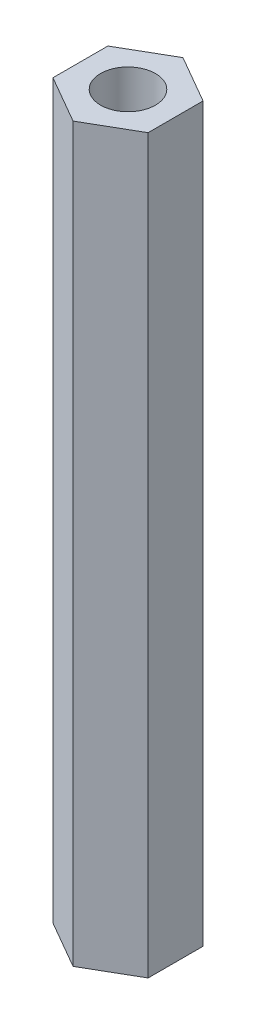
ISO-10303-21;
HEADER;
FILE_DESCRIPTION(('STEP AP214'),'2;1');
FILE_NAME('part.step','',(''),(''),'','','');
FILE_SCHEMA(('AUTOMOTIVE_DESIGN { 1 0 10303 214 1 1 1 1 }'));
ENDSEC;
DATA;
#1=APPLICATION_CONTEXT('core data for automotive mechanical design processes');
#2=APPLICATION_PROTOCOL_DEFINITION('international standard','automotive_design',2000,#1);
#3=PRODUCT_CONTEXT('',#1,'mechanical');
#4=PRODUCT('Part','Part','',(#3));
#5=PRODUCT_RELATED_PRODUCT_CATEGORY('part','',(#4));
#6=PRODUCT_DEFINITION_FORMATION('','',#4);
#7=PRODUCT_DEFINITION_CONTEXT('part definition',#1,'design');
#8=PRODUCT_DEFINITION('design','',#6,#7);
#9=PRODUCT_DEFINITION_SHAPE('','',#8);
#10=(LENGTH_UNIT() NAMED_UNIT(*) SI_UNIT(.MILLI.,.METRE.));
#11=(NAMED_UNIT(*) PLANE_ANGLE_UNIT() SI_UNIT($,.RADIAN.));
#12=(NAMED_UNIT(*) SI_UNIT($,.STERADIAN.) SOLID_ANGLE_UNIT());
#13=UNCERTAINTY_MEASURE_WITH_UNIT(LENGTH_MEASURE(1.E-05),#10,'distance_accuracy_value','');
#14=(GEOMETRIC_REPRESENTATION_CONTEXT(3) GLOBAL_UNCERTAINTY_ASSIGNED_CONTEXT((#13)) GLOBAL_UNIT_ASSIGNED_CONTEXT((#10,
#11,#12)) REPRESENTATION_CONTEXT('',''));
#15=CARTESIAN_POINT('',(0.,0.,0.));
#16=DIRECTION('',(0.,0.,1.));
#17=DIRECTION('',(1.,0.,0.));
#18=AXIS2_PLACEMENT_3D('',#15,#16,#17);
#19=CARTESIAN_POINT('',(0.,40.,0.));
#20=DIRECTION('',(0.,1.,0.));
#21=DIRECTION('',(0.,0.,1.));
#22=AXIS2_PLACEMENT_3D('',#19,#20,#21);
#23=PLANE('',#22);
#24=DIRECTION('',(-0.866025403784439,0.,-0.499999999999999));
#25=VECTOR('',#24,1.);
#26=CARTESIAN_POINT('',(2.6,40.,-1.50111069989303));
#27=LINE('',#26,#25);
#28=CARTESIAN_POINT('',(2.6,40.,-1.50111069989303));
#29=VERTEX_POINT('',#28);
#30=CARTESIAN_POINT('',(0.,40.,-3.00222139978605));
#31=VERTEX_POINT('',#30);
#32=EDGE_CURVE('E150',#29,#31,#27,.T.);
#33=ORIENTED_EDGE('',*,*,#32,.T.);
#34=DIRECTION('',(-0.866025403784438,0.,0.500000000000001));
#35=VECTOR('',#34,1.);
#36=CARTESIAN_POINT('',(0.,40.,-3.00222139978605));
#37=LINE('',#36,#35);
#38=CARTESIAN_POINT('',(-2.6,40.,-1.50111069989303));
#39=VERTEX_POINT('',#38);
#40=EDGE_CURVE('E98',#31,#39,#37,.T.);
#41=ORIENTED_EDGE('',*,*,#40,.T.);
#42=DIRECTION('',(0.,0.,1.));
#43=VECTOR('',#42,1.);
#44=CARTESIAN_POINT('',(-2.6,40.,-1.50111069989303));
#45=LINE('',#44,#43);
#46=CARTESIAN_POINT('',(-2.6,40.,1.50111069989303));
#47=VERTEX_POINT('',#46);
#48=EDGE_CURVE('E111',#39,#47,#45,.T.);
#49=ORIENTED_EDGE('',*,*,#48,.T.);
#50=DIRECTION('',(0.866025403784437,0.,0.500000000000003));
#51=VECTOR('',#50,1.);
#52=CARTESIAN_POINT('',(-2.6,40.,1.50111069989303));
#53=LINE('',#52,#51);
#54=CARTESIAN_POINT('',(0.,40.,3.00222139978606));
#55=VERTEX_POINT('',#54);
#56=EDGE_CURVE('E105',#47,#55,#53,.T.);
#57=ORIENTED_EDGE('',*,*,#56,.T.);
#58=DIRECTION('',(0.866025403784438,0.,-0.5));
#59=VECTOR('',#58,1.);
#60=CARTESIAN_POINT('',(0.,40.,3.00222139978606));
#61=LINE('',#60,#59);
#62=CARTESIAN_POINT('',(2.6,40.,1.50111069989303));
#63=VERTEX_POINT('',#62);
#64=EDGE_CURVE('E109',#55,#63,#61,.T.);
#65=ORIENTED_EDGE('',*,*,#64,.T.);
#66=DIRECTION('',(0.,0.,-1.));
#67=VECTOR('',#66,1.);
#68=CARTESIAN_POINT('',(2.6,40.,1.50111069989303));
#69=LINE('',#68,#67);
#70=EDGE_CURVE('E61',#63,#29,#69,.T.);
#71=ORIENTED_EDGE('',*,*,#70,.T.);
#72=EDGE_LOOP('',(#33,#41,#49,#57,#65,#71));
#73=FACE_BOUND('',#72,.T.);
#74=CARTESIAN_POINT('',(0.,40.,0.));
#75=DIRECTION('',(0.,1.,0.));
#76=DIRECTION('',(0.,0.,1.));
#77=AXIS2_PLACEMENT_3D('',#74,#75,#76);
#78=CIRCLE('',#77,1.5);
#79=CARTESIAN_POINT('',(0.,40.,1.5));
#80=VERTEX_POINT('',#79);
#81=EDGE_CURVE('E138',#80,#80,#78,.T.);
#82=ORIENTED_EDGE('',*,*,#81,.F.);
#83=EDGE_LOOP('',(#82));
#84=FACE_BOUND('',#83,.T.);
#85=ADVANCED_FACE('F43',(#73,#84),#23,.T.);
#86=CARTESIAN_POINT('',(0.,0.,0.));
#87=DIRECTION('',(0.,1.,0.));
#88=DIRECTION('',(0.,0.,1.));
#89=AXIS2_PLACEMENT_3D('',#86,#87,#88);
#90=PLANE('',#89);
#91=DIRECTION('',(-0.866025403784439,0.,-0.499999999999999));
#92=VECTOR('',#91,1.);
#93=CARTESIAN_POINT('',(2.6,0.,-1.50111069989303));
#94=LINE('',#93,#92);
#95=CARTESIAN_POINT('',(2.6,0.,-1.50111069989303));
#96=VERTEX_POINT('',#95);
#97=CARTESIAN_POINT('',(0.,0.,-3.00222139978605));
#98=VERTEX_POINT('',#97);
#99=EDGE_CURVE('E133',#96,#98,#94,.T.);
#100=ORIENTED_EDGE('',*,*,#99,.F.);
#101=DIRECTION('',(0.,0.,-1.));
#102=VECTOR('',#101,1.);
#103=CARTESIAN_POINT('',(2.6,0.,1.50111069989303));
#104=LINE('',#103,#102);
#105=CARTESIAN_POINT('',(2.6,0.,1.50111069989303));
#106=VERTEX_POINT('',#105);
#107=EDGE_CURVE('E90',#106,#96,#104,.T.);
#108=ORIENTED_EDGE('',*,*,#107,.F.);
#109=DIRECTION('',(0.866025403784438,0.,-0.5));
#110=VECTOR('',#109,1.);
#111=CARTESIAN_POINT('',(0.,0.,3.00222139978606));
#112=LINE('',#111,#110);
#113=CARTESIAN_POINT('',(0.,0.,3.00222139978606));
#114=VERTEX_POINT('',#113);
#115=EDGE_CURVE('E84',#114,#106,#112,.T.);
#116=ORIENTED_EDGE('',*,*,#115,.F.);
#117=DIRECTION('',(0.866025403784437,0.,0.500000000000003));
#118=VECTOR('',#117,1.);
#119=CARTESIAN_POINT('',(-2.6,0.,1.50111069989303));
#120=LINE('',#119,#118);
#121=CARTESIAN_POINT('',(-2.6,0.,1.50111069989303));
#122=VERTEX_POINT('',#121);
#123=EDGE_CURVE('E120',#122,#114,#120,.T.);
#124=ORIENTED_EDGE('',*,*,#123,.F.);
#125=DIRECTION('',(0.,0.,1.));
#126=VECTOR('',#125,1.);
#127=CARTESIAN_POINT('',(-2.6,0.,-1.50111069989303));
#128=LINE('',#127,#126);
#129=CARTESIAN_POINT('',(-2.6,0.,-1.50111069989303));
#130=VERTEX_POINT('',#129);
#131=EDGE_CURVE('E141',#130,#122,#128,.T.);
#132=ORIENTED_EDGE('',*,*,#131,.F.);
#133=DIRECTION('',(-0.866025403784438,0.,0.500000000000001));
#134=VECTOR('',#133,1.);
#135=CARTESIAN_POINT('',(0.,0.,-3.00222139978605));
#136=LINE('',#135,#134);
#137=EDGE_CURVE('E137',#98,#130,#136,.T.);
#138=ORIENTED_EDGE('',*,*,#137,.F.);
#139=EDGE_LOOP('',(#100,#108,#116,#124,#132,#138));
#140=FACE_BOUND('',#139,.T.);
#141=CARTESIAN_POINT('',(0.,0.,0.));
#142=DIRECTION('',(0.,1.,0.));
#143=DIRECTION('',(0.,0.,1.));
#144=AXIS2_PLACEMENT_3D('',#141,#142,#143);
#145=CIRCLE('',#144,1.5);
#146=CARTESIAN_POINT('',(0.,0.,1.5));
#147=VERTEX_POINT('',#146);
#148=EDGE_CURVE('E265',#147,#147,#145,.T.);
#149=ORIENTED_EDGE('',*,*,#148,.T.);
#150=EDGE_LOOP('',(#149));
#151=FACE_BOUND('',#150,.T.);
#152=ADVANCED_FACE('F163',(#140,#151),#90,.F.);
#153=CARTESIAN_POINT('',(2.6,40.,-1.50111069989303));
#154=DIRECTION('',(-0.499999999999999,0.,0.866025403784439));
#155=DIRECTION('',(0.866025403784439,0.,0.499999999999999));
#156=AXIS2_PLACEMENT_3D('',#153,#154,#155);
#157=PLANE('',#156);
#158=ORIENTED_EDGE('',*,*,#99,.T.);
#159=DIRECTION('',(0.,-1.,0.));
#160=VECTOR('',#159,1.);
#161=CARTESIAN_POINT('',(0.,40.,-3.00222139978605));
#162=LINE('',#161,#160);
#163=EDGE_CURVE('E11',#31,#98,#162,.T.);
#164=ORIENTED_EDGE('',*,*,#163,.F.);
#165=ORIENTED_EDGE('',*,*,#32,.F.);
#166=DIRECTION('',(0.,-1.,0.));
#167=VECTOR('',#166,1.);
#168=CARTESIAN_POINT('',(2.6,40.,-1.50111069989303));
#169=LINE('',#168,#167);
#170=EDGE_CURVE('E129',#29,#96,#169,.T.);
#171=ORIENTED_EDGE('',*,*,#170,.T.);
#172=EDGE_LOOP('',(#158,#164,#165,#171));
#173=FACE_BOUND('',#172,.T.);
#174=ADVANCED_FACE('F45',(#173),#157,.F.);
#175=CARTESIAN_POINT('',(0.,40.,-3.00222139978605));
#176=DIRECTION('',(0.500000000000001,0.,0.866025403784438));
#177=DIRECTION('',(0.866025403784438,0.,-0.500000000000001));
#178=AXIS2_PLACEMENT_3D('',#175,#176,#177);
#179=PLANE('',#178);
#180=ORIENTED_EDGE('',*,*,#137,.T.);
#181=DIRECTION('',(0.,-1.,0.));
#182=VECTOR('',#181,1.);
#183=CARTESIAN_POINT('',(-2.6,40.,-1.50111069989303));
#184=LINE('',#183,#182);
#185=EDGE_CURVE('E53',#39,#130,#184,.T.);
#186=ORIENTED_EDGE('',*,*,#185,.F.);
#187=ORIENTED_EDGE('',*,*,#40,.F.);
#188=ORIENTED_EDGE('',*,*,#163,.T.);
#189=EDGE_LOOP('',(#180,#186,#187,#188));
#190=FACE_BOUND('',#189,.T.);
#191=ADVANCED_FACE('F188',(#190),#179,.F.);
#192=CARTESIAN_POINT('',(-2.6,40.,-1.50111069989303));
#193=DIRECTION('',(1.,0.,0.));
#194=DIRECTION('',(0.,0.,-1.));
#195=AXIS2_PLACEMENT_3D('',#192,#193,#194);
#196=PLANE('',#195);
#197=ORIENTED_EDGE('',*,*,#131,.T.);
#198=DIRECTION('',(0.,-1.,0.));
#199=VECTOR('',#198,1.);
#200=CARTESIAN_POINT('',(-2.6,40.,1.50111069989303));
#201=LINE('',#200,#199);
#202=EDGE_CURVE('E122',#47,#122,#201,.T.);
#203=ORIENTED_EDGE('',*,*,#202,.F.);
#204=ORIENTED_EDGE('',*,*,#48,.F.);
#205=ORIENTED_EDGE('',*,*,#185,.T.);
#206=EDGE_LOOP('',(#197,#203,#204,#205));
#207=FACE_BOUND('',#206,.T.);
#208=ADVANCED_FACE('F160',(#207),#196,.F.);
#209=CARTESIAN_POINT('',(-2.6,40.,1.50111069989303));
#210=DIRECTION('',(0.500000000000003,0.,-0.866025403784437));
#211=DIRECTION('',(-0.866025403784437,0.,-0.500000000000003));
#212=AXIS2_PLACEMENT_3D('',#209,#210,#211);
#213=PLANE('',#212);
#214=ORIENTED_EDGE('',*,*,#123,.T.);
#215=DIRECTION('',(0.,-1.,0.));
#216=VECTOR('',#215,1.);
#217=CARTESIAN_POINT('',(0.,40.,3.00222139978606));
#218=LINE('',#217,#216);
#219=EDGE_CURVE('E117',#55,#114,#218,.T.);
#220=ORIENTED_EDGE('',*,*,#219,.F.);
#221=ORIENTED_EDGE('',*,*,#56,.F.);
#222=ORIENTED_EDGE('',*,*,#202,.T.);
#223=EDGE_LOOP('',(#214,#220,#221,#222));
#224=FACE_BOUND('',#223,.T.);
#225=ADVANCED_FACE('F118',(#224),#213,.F.);
#226=CARTESIAN_POINT('',(0.,40.,3.00222139978606));
#227=DIRECTION('',(-0.5,0.,-0.866025403784438));
#228=DIRECTION('',(-0.866025403784439,0.,0.5));
#229=AXIS2_PLACEMENT_3D('',#226,#227,#228);
#230=PLANE('',#229);
#231=ORIENTED_EDGE('',*,*,#115,.T.);
#232=DIRECTION('',(0.,-1.,0.));
#233=VECTOR('',#232,1.);
#234=CARTESIAN_POINT('',(2.6,40.,1.50111069989303));
#235=LINE('',#234,#233);
#236=EDGE_CURVE('E123',#63,#106,#235,.T.);
#237=ORIENTED_EDGE('',*,*,#236,.F.);
#238=ORIENTED_EDGE('',*,*,#64,.F.);
#239=ORIENTED_EDGE('',*,*,#219,.T.);
#240=EDGE_LOOP('',(#231,#237,#238,#239));
#241=FACE_BOUND('',#240,.T.);
#242=ADVANCED_FACE('F125',(#241),#230,.F.);
#243=CARTESIAN_POINT('',(2.6,40.,1.50111069989303));
#244=DIRECTION('',(-1.,0.,0.));
#245=DIRECTION('',(0.,0.,1.));
#246=AXIS2_PLACEMENT_3D('',#243,#244,#245);
#247=PLANE('',#246);
#248=ORIENTED_EDGE('',*,*,#107,.T.);
#249=ORIENTED_EDGE('',*,*,#170,.F.);
#250=ORIENTED_EDGE('',*,*,#70,.F.);
#251=ORIENTED_EDGE('',*,*,#236,.T.);
#252=EDGE_LOOP('',(#248,#249,#250,#251));
#253=FACE_BOUND('',#252,.T.);
#254=ADVANCED_FACE('F168',(#253),#247,.F.);
#255=CARTESIAN_POINT('',(0.,40.,0.));
#256=DIRECTION('',(0.,-1.,0.));
#257=DIRECTION('',(0.,0.,-1.));
#258=AXIS2_PLACEMENT_3D('',#255,#256,#257);
#259=CYLINDRICAL_SURFACE('',#258,1.5);
#260=ORIENTED_EDGE('',*,*,#81,.T.);
#261=EDGE_LOOP('',(#260));
#262=FACE_BOUND('',#261,.T.);
#263=ORIENTED_EDGE('',*,*,#148,.F.);
#264=EDGE_LOOP('',(#263));
#265=FACE_BOUND('',#264,.T.);
#266=ADVANCED_FACE('F170',(#262,#265),#259,.F.);
#267=CLOSED_SHELL('',(#85,#152,#174,#191,#208,#225,#242,#254,#266));
#268=MANIFOLD_SOLID_BREP('B2',#267);
#269=ADVANCED_BREP_SHAPE_REPRESENTATION('',(#18,#268),#14);
#270=SHAPE_DEFINITION_REPRESENTATION(#9,#269);
ENDSEC;
END-ISO-10303-21;
